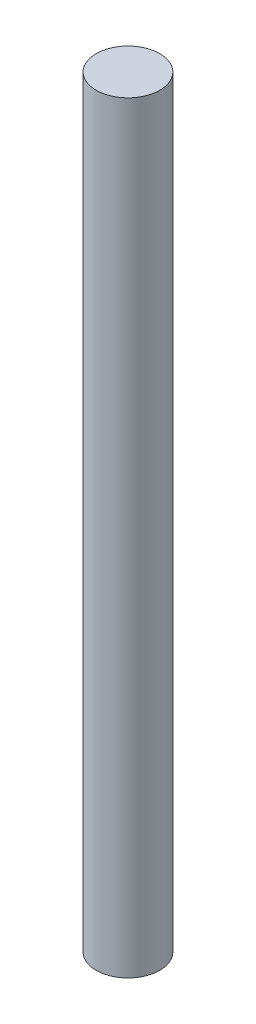
ISO-10303-21;
HEADER;
FILE_DESCRIPTION(('STEP AP214'),'2;1');
FILE_NAME('part.step','',(''),(''),'','','');
FILE_SCHEMA(('AUTOMOTIVE_DESIGN { 1 0 10303 214 1 1 1 1 }'));
ENDSEC;
DATA;
#1=APPLICATION_CONTEXT('core data for automotive mechanical design processes');
#2=APPLICATION_PROTOCOL_DEFINITION('international standard','automotive_design',2000,#1);
#3=PRODUCT_CONTEXT('',#1,'mechanical');
#4=PRODUCT('Part','Part','',(#3));
#5=PRODUCT_RELATED_PRODUCT_CATEGORY('part','',(#4));
#6=PRODUCT_DEFINITION_FORMATION('','',#4);
#7=PRODUCT_DEFINITION_CONTEXT('part definition',#1,'design');
#8=PRODUCT_DEFINITION('design','',#6,#7);
#9=PRODUCT_DEFINITION_SHAPE('','',#8);
#10=(LENGTH_UNIT() NAMED_UNIT(*) SI_UNIT(.MILLI.,.METRE.));
#11=(NAMED_UNIT(*) PLANE_ANGLE_UNIT() SI_UNIT($,.RADIAN.));
#12=(NAMED_UNIT(*) SI_UNIT($,.STERADIAN.) SOLID_ANGLE_UNIT());
#13=UNCERTAINTY_MEASURE_WITH_UNIT(LENGTH_MEASURE(1.E-05),#10,'distance_accuracy_value','');
#14=(GEOMETRIC_REPRESENTATION_CONTEXT(3) GLOBAL_UNCERTAINTY_ASSIGNED_CONTEXT((#13)) GLOBAL_UNIT_ASSIGNED_CONTEXT((#10,
#11,#12)) REPRESENTATION_CONTEXT('',''));
#15=CARTESIAN_POINT('',(0.,0.,0.));
#16=DIRECTION('',(0.,0.,1.));
#17=DIRECTION('',(1.,0.,0.));
#18=AXIS2_PLACEMENT_3D('',#15,#16,#17);
#19=CARTESIAN_POINT('',(0.,152.4,0.));
#20=DIRECTION('',(0.,-1.,0.));
#21=DIRECTION('',(0.,0.,-1.));
#22=AXIS2_PLACEMENT_3D('',#19,#20,#21);
#23=CYLINDRICAL_SURFACE('',#22,6.35);
#24=CARTESIAN_POINT('',(0.,152.4,0.));
#25=DIRECTION('',(0.,1.,0.));
#26=DIRECTION('',(0.,0.,1.));
#27=AXIS2_PLACEMENT_3D('',#24,#25,#26);
#28=CIRCLE('',#27,6.35);
#29=CARTESIAN_POINT('',(0.,152.4,6.35));
#30=VERTEX_POINT('',#29);
#31=EDGE_CURVE('E10',#30,#30,#28,.T.);
#32=ORIENTED_EDGE('',*,*,#31,.F.);
#33=EDGE_LOOP('',(#32));
#34=FACE_BOUND('',#33,.T.);
#35=CARTESIAN_POINT('',(0.,0.,0.));
#36=DIRECTION('',(0.,1.,0.));
#37=DIRECTION('',(0.,0.,1.));
#38=AXIS2_PLACEMENT_3D('',#35,#36,#37);
#39=CIRCLE('',#38,6.35);
#40=CARTESIAN_POINT('',(0.,0.,6.35));
#41=VERTEX_POINT('',#40);
#42=EDGE_CURVE('E36',#41,#41,#39,.T.);
#43=ORIENTED_EDGE('',*,*,#42,.T.);
#44=EDGE_LOOP('',(#43));
#45=FACE_BOUND('',#44,.T.);
#46=ADVANCED_FACE('F33',(#34,#45),#23,.T.);
#47=CARTESIAN_POINT('',(0.,152.4,0.));
#48=DIRECTION('',(0.,1.,0.));
#49=DIRECTION('',(0.,0.,1.));
#50=AXIS2_PLACEMENT_3D('',#47,#48,#49);
#51=PLANE('',#50);
#52=ORIENTED_EDGE('',*,*,#31,.T.);
#53=EDGE_LOOP('',(#52));
#54=FACE_BOUND('',#53,.T.);
#55=ADVANCED_FACE('F48',(#54),#51,.T.);
#56=CARTESIAN_POINT('',(0.,0.,0.));
#57=DIRECTION('',(0.,1.,0.));
#58=DIRECTION('',(0.,0.,1.));
#59=AXIS2_PLACEMENT_3D('',#56,#57,#58);
#60=PLANE('',#59);
#61=ORIENTED_EDGE('',*,*,#42,.F.);
#62=EDGE_LOOP('',(#61));
#63=FACE_BOUND('',#62,.T.);
#64=ADVANCED_FACE('F46',(#63),#60,.F.);
#65=CLOSED_SHELL('',(#46,#55,#64));
#66=MANIFOLD_SOLID_BREP('B2',#65);
#67=ADVANCED_BREP_SHAPE_REPRESENTATION('',(#18,#66),#14);
#68=SHAPE_DEFINITION_REPRESENTATION(#9,#67);
ENDSEC;
END-ISO-10303-21;
